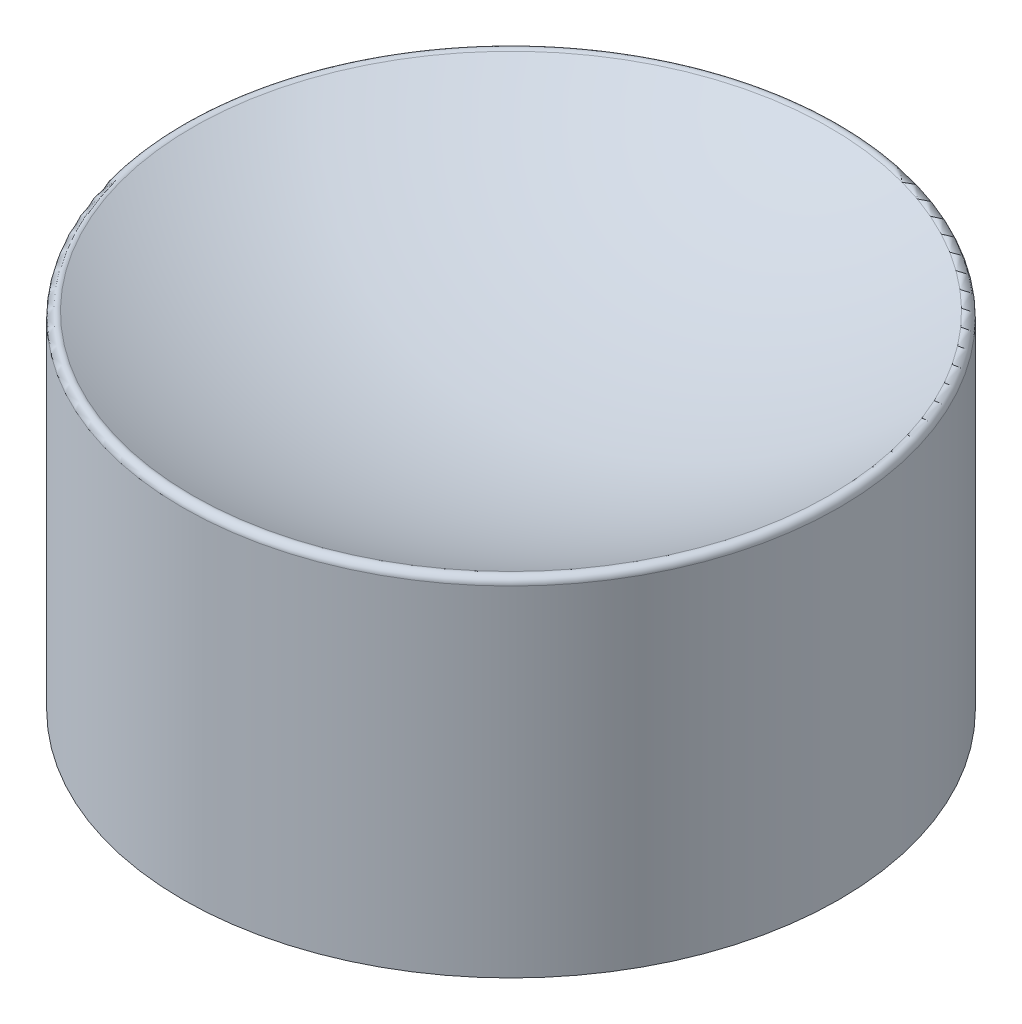
ISO-10303-21;
HEADER;
FILE_DESCRIPTION(('STEP AP214'),'2;1');
FILE_NAME('part.step','',(''),(''),'','','');
FILE_SCHEMA(('AUTOMOTIVE_DESIGN { 1 0 10303 214 1 1 1 1 }'));
ENDSEC;
DATA;
#1=APPLICATION_CONTEXT('core data for automotive mechanical design processes');
#2=APPLICATION_PROTOCOL_DEFINITION('international standard','automotive_design',2000,#1);
#3=PRODUCT_CONTEXT('',#1,'mechanical');
#4=PRODUCT('Part','Part','',(#3));
#5=PRODUCT_RELATED_PRODUCT_CATEGORY('part','',(#4));
#6=PRODUCT_DEFINITION_FORMATION('','',#4);
#7=PRODUCT_DEFINITION_CONTEXT('part definition',#1,'design');
#8=PRODUCT_DEFINITION('design','',#6,#7);
#9=PRODUCT_DEFINITION_SHAPE('','',#8);
#10=(LENGTH_UNIT() NAMED_UNIT(*) SI_UNIT(.MILLI.,.METRE.));
#11=(NAMED_UNIT(*) PLANE_ANGLE_UNIT() SI_UNIT($,.RADIAN.));
#12=(NAMED_UNIT(*) SI_UNIT($,.STERADIAN.) SOLID_ANGLE_UNIT());
#13=UNCERTAINTY_MEASURE_WITH_UNIT(LENGTH_MEASURE(1.E-05),#10,'distance_accuracy_value','');
#14=(GEOMETRIC_REPRESENTATION_CONTEXT(3) GLOBAL_UNCERTAINTY_ASSIGNED_CONTEXT((#13)) GLOBAL_UNIT_ASSIGNED_CONTEXT((#10,
#11,#12)) REPRESENTATION_CONTEXT('',''));
#15=CARTESIAN_POINT('',(0.,0.,0.));
#16=DIRECTION('',(0.,0.,1.));
#17=DIRECTION('',(1.,0.,0.));
#18=AXIS2_PLACEMENT_3D('',#15,#16,#17);
#19=CARTESIAN_POINT('',(0.,8.,0.));
#20=DIRECTION('',(0.,-1.,0.));
#21=DIRECTION('',(0.,0.,-1.));
#22=AXIS2_PLACEMENT_3D('',#19,#20,#21);
#23=CYLINDRICAL_SURFACE('',#22,5.);
#24=CARTESIAN_POINT('',(0.,5.16823913367215,0.));
#25=DIRECTION('',(0.,1.,0.));
#26=DIRECTION('',(0.,0.,1.));
#27=AXIS2_PLACEMENT_3D('',#24,#25,#26);
#28=CIRCLE('',#27,5.);
#29=CARTESIAN_POINT('',(0.,5.16823913367215,5.));
#30=VERTEX_POINT('',#29);
#31=EDGE_CURVE('E10',#30,#30,#28,.F.);
#32=ORIENTED_EDGE('',*,*,#31,.T.);
#33=EDGE_LOOP('',(#32));
#34=FACE_BOUND('',#33,.T.);
#35=CARTESIAN_POINT('',(0.,0.,0.));
#36=DIRECTION('',(0.,1.,0.));
#37=DIRECTION('',(0.,0.,1.));
#38=AXIS2_PLACEMENT_3D('',#35,#36,#37);
#39=CIRCLE('',#38,5.);
#40=CARTESIAN_POINT('',(0.,0.,5.));
#41=VERTEX_POINT('',#40);
#42=EDGE_CURVE('E50',#41,#41,#39,.T.);
#43=ORIENTED_EDGE('',*,*,#42,.T.);
#44=EDGE_LOOP('',(#43));
#45=FACE_BOUND('',#44,.T.);
#46=ADVANCED_FACE('F37',(#34,#45),#23,.T.);
#47=CARTESIAN_POINT('',(0.,0.,0.));
#48=DIRECTION('',(0.,1.,0.));
#49=DIRECTION('',(0.,0.,1.));
#50=AXIS2_PLACEMENT_3D('',#47,#48,#49);
#51=PLANE('',#50);
#52=ORIENTED_EDGE('',*,*,#42,.F.);
#53=EDGE_LOOP('',(#52));
#54=FACE_BOUND('',#53,.T.);
#55=ADVANCED_FACE('F59',(#54),#51,.F.);
#56=CARTESIAN_POINT('',(0.,14.,0.));
#57=DIRECTION('',(0.,1.,0.));
#58=DIRECTION('',(1.,0.,0.));
#59=AXIS2_PLACEMENT_3D('',#56,#57,#58);
#60=SPHERICAL_SURFACE('',#59,10.);
#61=CARTESIAN_POINT('',(0.,5.25568231056649,0.));
#62=DIRECTION('',(0.,1.,0.));
#63=DIRECTION('',(0.,0.,1.));
#64=AXIS2_PLACEMENT_3D('',#61,#62,#63);
#65=CIRCLE('',#64,4.85148514851485);
#66=CARTESIAN_POINT('',(0.,5.25568231056649,4.85148514851485));
#67=VERTEX_POINT('',#66);
#68=EDGE_CURVE('E45',#67,#67,#65,.T.);
#69=ORIENTED_EDGE('',*,*,#68,.T.);
#70=EDGE_LOOP('',(#69));
#71=FACE_BOUND('',#70,.T.);
#72=ADVANCED_FACE('F61',(#71),#60,.F.);
#73=CARTESIAN_POINT('',(0.,5.16823913367215,0.));
#74=DIRECTION('',(0.,1.,0.));
#75=DIRECTION('',(0.,0.,1.));
#76=AXIS2_PLACEMENT_3D('',#73,#74,#75);
#77=TOROIDAL_SURFACE('',#76,4.9,0.1);
#78=ORIENTED_EDGE('',*,*,#31,.F.);
#79=EDGE_LOOP('',(#78));
#80=FACE_BOUND('',#79,.T.);
#81=ORIENTED_EDGE('',*,*,#68,.F.);
#82=EDGE_LOOP('',(#81));
#83=FACE_BOUND('',#82,.T.);
#84=ADVANCED_FACE('F39',(#80,#83),#77,.T.);
#85=CLOSED_SHELL('',(#46,#55,#72,#84));
#86=MANIFOLD_SOLID_BREP('B2',#85);
#87=ADVANCED_BREP_SHAPE_REPRESENTATION('',(#18,#86),#14);
#88=SHAPE_DEFINITION_REPRESENTATION(#9,#87);
ENDSEC;
END-ISO-10303-21;
